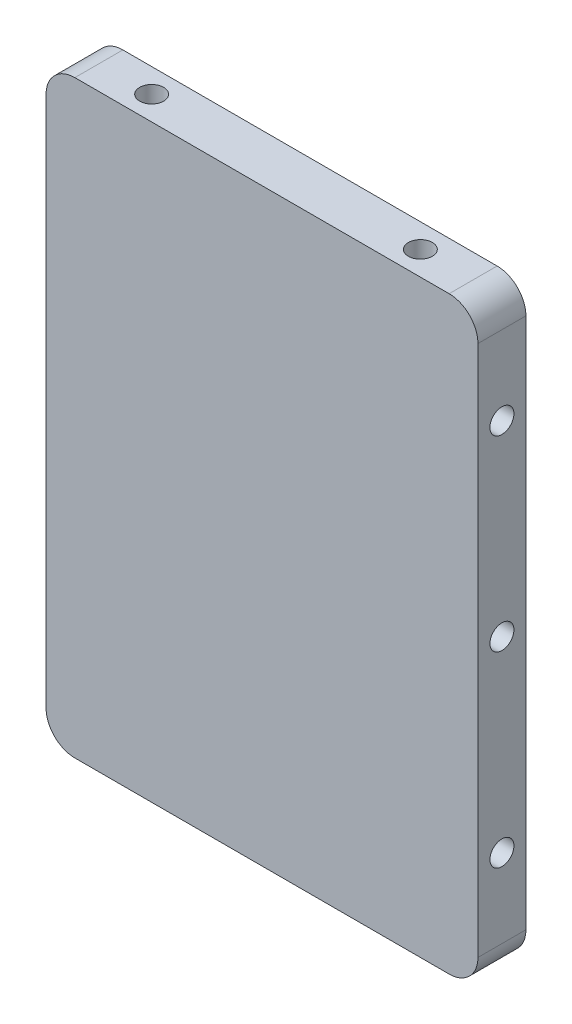
ISO-10303-21;
HEADER;
FILE_DESCRIPTION(('STEP AP214'),'2;1');
FILE_NAME('part.step','',(''),(''),'','','');
FILE_SCHEMA(('AUTOMOTIVE_DESIGN { 1 0 10303 214 1 1 1 1 }'));
ENDSEC;
DATA;
#1=APPLICATION_CONTEXT('core data for automotive mechanical design processes');
#2=APPLICATION_PROTOCOL_DEFINITION('international standard','automotive_design',2000,#1);
#3=PRODUCT_CONTEXT('',#1,'mechanical');
#4=PRODUCT('Part','Part','',(#3));
#5=PRODUCT_RELATED_PRODUCT_CATEGORY('part','',(#4));
#6=PRODUCT_DEFINITION_FORMATION('','',#4);
#7=PRODUCT_DEFINITION_CONTEXT('part definition',#1,'design');
#8=PRODUCT_DEFINITION('design','',#6,#7);
#9=PRODUCT_DEFINITION_SHAPE('','',#8);
#10=(LENGTH_UNIT() NAMED_UNIT(*) SI_UNIT(.MILLI.,.METRE.));
#11=(NAMED_UNIT(*) PLANE_ANGLE_UNIT() SI_UNIT($,.RADIAN.));
#12=(NAMED_UNIT(*) SI_UNIT($,.STERADIAN.) SOLID_ANGLE_UNIT());
#13=UNCERTAINTY_MEASURE_WITH_UNIT(LENGTH_MEASURE(1.E-05),#10,'distance_accuracy_value','');
#14=(GEOMETRIC_REPRESENTATION_CONTEXT(3) GLOBAL_UNCERTAINTY_ASSIGNED_CONTEXT((#13)) GLOBAL_UNIT_ASSIGNED_CONTEXT((#10,
#11,#12)) REPRESENTATION_CONTEXT('',''));
#15=CARTESIAN_POINT('',(0.,0.,0.));
#16=DIRECTION('',(0.,0.,1.));
#17=DIRECTION('',(1.,0.,0.));
#18=AXIS2_PLACEMENT_3D('',#15,#16,#17);
#19=CARTESIAN_POINT('',(22.5,-30.7,5.));
#20=DIRECTION('',(-1.,0.,0.));
#21=DIRECTION('',(0.,0.,1.));
#22=AXIS2_PLACEMENT_3D('',#19,#20,#21);
#23=PLANE('',#22);
#24=CARTESIAN_POINT('',(22.5,-19.5,2.5));
#25=DIRECTION('',(1.,0.,0.));
#26=DIRECTION('',(0.,0.,-1.));
#27=AXIS2_PLACEMENT_3D('',#24,#25,#26);
#28=CIRCLE('',#27,1.24999999999999);
#29=CARTESIAN_POINT('',(22.5,-19.5,1.25000000000001));
#30=VERTEX_POINT('',#29);
#31=EDGE_CURVE('E132',#30,#30,#28,.T.);
#32=ORIENTED_EDGE('',*,*,#31,.F.);
#33=EDGE_LOOP('',(#32));
#34=FACE_BOUND('',#33,.T.);
#35=CARTESIAN_POINT('',(22.5,19.5,2.5));
#36=DIRECTION('',(1.,0.,0.));
#37=DIRECTION('',(0.,0.,-1.));
#38=AXIS2_PLACEMENT_3D('',#35,#36,#37);
#39=CIRCLE('',#38,1.24999999999999);
#40=CARTESIAN_POINT('',(22.5,19.5,1.25000000000001));
#41=VERTEX_POINT('',#40);
#42=EDGE_CURVE('E131',#41,#41,#39,.T.);
#43=ORIENTED_EDGE('',*,*,#42,.F.);
#44=EDGE_LOOP('',(#43));
#45=FACE_BOUND('',#44,.T.);
#46=CARTESIAN_POINT('',(22.5,0.,2.5));
#47=DIRECTION('',(1.,0.,0.));
#48=DIRECTION('',(0.,0.,-1.));
#49=AXIS2_PLACEMENT_3D('',#46,#47,#48);
#50=CIRCLE('',#49,1.24999999999999);
#51=CARTESIAN_POINT('',(22.5,0.,1.25000000000001));
#52=VERTEX_POINT('',#51);
#53=EDGE_CURVE('E142',#52,#52,#50,.T.);
#54=ORIENTED_EDGE('',*,*,#53,.F.);
#55=EDGE_LOOP('',(#54));
#56=FACE_BOUND('',#55,.T.);
#57=DIRECTION('',(0.,1.,0.));
#58=VECTOR('',#57,1.);
#59=CARTESIAN_POINT('',(22.5,-30.7,5.));
#60=LINE('',#59,#58);
#61=CARTESIAN_POINT('',(22.5,-27.7,5.));
#62=VERTEX_POINT('',#61);
#63=CARTESIAN_POINT('',(22.5,27.7,5.));
#64=VERTEX_POINT('',#63);
#65=EDGE_CURVE('E179',#62,#64,#60,.T.);
#66=ORIENTED_EDGE('',*,*,#65,.F.);
#67=DIRECTION('',(0.,0.,-1.));
#68=VECTOR('',#67,1.);
#69=CARTESIAN_POINT('',(22.5,-27.7,5.));
#70=LINE('',#69,#68);
#71=CARTESIAN_POINT('',(22.5,-27.7,0.));
#72=VERTEX_POINT('',#71);
#73=EDGE_CURVE('E201',#62,#72,#70,.T.);
#74=ORIENTED_EDGE('',*,*,#73,.T.);
#75=DIRECTION('',(0.,1.,0.));
#76=VECTOR('',#75,1.);
#77=CARTESIAN_POINT('',(22.5,-30.7,0.));
#78=LINE('',#77,#76);
#79=CARTESIAN_POINT('',(22.5,27.7,0.));
#80=VERTEX_POINT('',#79);
#81=EDGE_CURVE('E178',#72,#80,#78,.T.);
#82=ORIENTED_EDGE('',*,*,#81,.T.);
#83=DIRECTION('',(0.,0.,-1.));
#84=VECTOR('',#83,1.);
#85=CARTESIAN_POINT('',(22.5,27.7,5.));
#86=LINE('',#85,#84);
#87=EDGE_CURVE('E190',#80,#64,#86,.F.);
#88=ORIENTED_EDGE('',*,*,#87,.T.);
#89=EDGE_LOOP('',(#66,#74,#82,#88));
#90=FACE_BOUND('',#89,.T.);
#91=ADVANCED_FACE('F38',(#34,#45,#56,#90),#23,.F.);
#92=CARTESIAN_POINT('',(-22.5,30.7,5.));
#93=DIRECTION('',(0.,-1.,0.));
#94=DIRECTION('',(0.,0.,-1.));
#95=AXIS2_PLACEMENT_3D('',#92,#93,#94);
#96=PLANE('',#95);
#97=CARTESIAN_POINT('',(-14.,30.7,2.5));
#98=DIRECTION('',(0.,-1.,0.));
#99=DIRECTION('',(0.,0.,-1.));
#100=AXIS2_PLACEMENT_3D('',#97,#98,#99);
#101=CIRCLE('',#100,1.24999999999998);
#102=CARTESIAN_POINT('',(-14.,30.7,1.25000000000002));
#103=VERTEX_POINT('',#102);
#104=EDGE_CURVE('E151',#103,#103,#101,.T.);
#105=ORIENTED_EDGE('',*,*,#104,.T.);
#106=EDGE_LOOP('',(#105));
#107=FACE_BOUND('',#106,.T.);
#108=CARTESIAN_POINT('',(14.,30.7,2.5));
#109=DIRECTION('',(0.,-1.,0.));
#110=DIRECTION('',(0.,0.,-1.));
#111=AXIS2_PLACEMENT_3D('',#108,#109,#110);
#112=CIRCLE('',#111,1.24999999999998);
#113=CARTESIAN_POINT('',(14.,30.7,1.25000000000002));
#114=VERTEX_POINT('',#113);
#115=EDGE_CURVE('E157',#114,#114,#112,.T.);
#116=ORIENTED_EDGE('',*,*,#115,.T.);
#117=EDGE_LOOP('',(#116));
#118=FACE_BOUND('',#117,.T.);
#119=DIRECTION('',(-1.,0.,0.));
#120=VECTOR('',#119,1.);
#121=CARTESIAN_POINT('',(-22.5,30.7,5.));
#122=LINE('',#121,#120);
#123=CARTESIAN_POINT('',(19.5,30.7,5.));
#124=VERTEX_POINT('',#123);
#125=CARTESIAN_POINT('',(-19.5,30.7,5.));
#126=VERTEX_POINT('',#125);
#127=EDGE_CURVE('E182',#124,#126,#122,.T.);
#128=ORIENTED_EDGE('',*,*,#127,.F.);
#129=DIRECTION('',(0.,0.,-1.));
#130=VECTOR('',#129,1.);
#131=CARTESIAN_POINT('',(19.5,30.7,5.));
#132=LINE('',#131,#130);
#133=CARTESIAN_POINT('',(19.5,30.7,0.));
#134=VERTEX_POINT('',#133);
#135=EDGE_CURVE('E11',#124,#134,#132,.T.);
#136=ORIENTED_EDGE('',*,*,#135,.T.);
#137=DIRECTION('',(-1.,0.,0.));
#138=VECTOR('',#137,1.);
#139=CARTESIAN_POINT('',(-22.5,30.7,0.));
#140=LINE('',#139,#138);
#141=CARTESIAN_POINT('',(-19.5,30.7,0.));
#142=VERTEX_POINT('',#141);
#143=EDGE_CURVE('E193',#134,#142,#140,.T.);
#144=ORIENTED_EDGE('',*,*,#143,.T.);
#145=DIRECTION('',(0.,0.,-1.));
#146=VECTOR('',#145,1.);
#147=CARTESIAN_POINT('',(-19.5,30.7,5.));
#148=LINE('',#147,#146);
#149=EDGE_CURVE('E46',#142,#126,#148,.F.);
#150=ORIENTED_EDGE('',*,*,#149,.T.);
#151=EDGE_LOOP('',(#128,#136,#144,#150));
#152=FACE_BOUND('',#151,.T.);
#153=ADVANCED_FACE('F230',(#107,#118,#152),#96,.F.);
#154=CARTESIAN_POINT('',(-22.5,-30.7,5.));
#155=DIRECTION('',(1.,0.,0.));
#156=DIRECTION('',(0.,0.,-1.));
#157=AXIS2_PLACEMENT_3D('',#154,#155,#156);
#158=PLANE('',#157);
#159=CARTESIAN_POINT('',(-22.5,-19.5,2.5));
#160=DIRECTION('',(-1.,0.,0.));
#161=DIRECTION('',(0.,0.,1.));
#162=AXIS2_PLACEMENT_3D('',#159,#160,#161);
#163=CIRCLE('',#162,1.24999999999999);
#164=CARTESIAN_POINT('',(-22.5,-19.5,3.74999999999999));
#165=VERTEX_POINT('',#164);
#166=EDGE_CURVE('E160',#165,#165,#163,.T.);
#167=ORIENTED_EDGE('',*,*,#166,.F.);
#168=EDGE_LOOP('',(#167));
#169=FACE_BOUND('',#168,.T.);
#170=CARTESIAN_POINT('',(-22.5,19.5,2.5));
#171=DIRECTION('',(-1.,0.,0.));
#172=DIRECTION('',(0.,0.,1.));
#173=AXIS2_PLACEMENT_3D('',#170,#171,#172);
#174=CIRCLE('',#173,1.24999999999999);
#175=CARTESIAN_POINT('',(-22.5,19.5,3.74999999999999));
#176=VERTEX_POINT('',#175);
#177=EDGE_CURVE('E166',#176,#176,#174,.T.);
#178=ORIENTED_EDGE('',*,*,#177,.F.);
#179=EDGE_LOOP('',(#178));
#180=FACE_BOUND('',#179,.T.);
#181=CARTESIAN_POINT('',(-22.5,0.,2.5));
#182=DIRECTION('',(-1.,0.,0.));
#183=DIRECTION('',(0.,0.,1.));
#184=AXIS2_PLACEMENT_3D('',#181,#182,#183);
#185=CIRCLE('',#184,1.24999999999999);
#186=CARTESIAN_POINT('',(-22.5,0.,3.74999999999999));
#187=VERTEX_POINT('',#186);
#188=EDGE_CURVE('E172',#187,#187,#185,.T.);
#189=ORIENTED_EDGE('',*,*,#188,.F.);
#190=EDGE_LOOP('',(#189));
#191=FACE_BOUND('',#190,.T.);
#192=DIRECTION('',(0.,-1.,0.));
#193=VECTOR('',#192,1.);
#194=CARTESIAN_POINT('',(-22.5,-30.7,0.));
#195=LINE('',#194,#193);
#196=CARTESIAN_POINT('',(-22.5,27.7,0.));
#197=VERTEX_POINT('',#196);
#198=CARTESIAN_POINT('',(-22.5,-27.7,0.));
#199=VERTEX_POINT('',#198);
#200=EDGE_CURVE('E196',#197,#199,#195,.T.);
#201=ORIENTED_EDGE('',*,*,#200,.T.);
#202=DIRECTION('',(0.,0.,-1.));
#203=VECTOR('',#202,1.);
#204=CARTESIAN_POINT('',(-22.5,-27.7,5.));
#205=LINE('',#204,#203);
#206=CARTESIAN_POINT('',(-22.5,-27.7,5.));
#207=VERTEX_POINT('',#206);
#208=EDGE_CURVE('E53',#199,#207,#205,.F.);
#209=ORIENTED_EDGE('',*,*,#208,.T.);
#210=DIRECTION('',(0.,-1.,0.));
#211=VECTOR('',#210,1.);
#212=CARTESIAN_POINT('',(-22.5,-30.7,5.));
#213=LINE('',#212,#211);
#214=CARTESIAN_POINT('',(-22.5,27.7,5.));
#215=VERTEX_POINT('',#214);
#216=EDGE_CURVE('E185',#215,#207,#213,.T.);
#217=ORIENTED_EDGE('',*,*,#216,.F.);
#218=DIRECTION('',(0.,0.,-1.));
#219=VECTOR('',#218,1.);
#220=CARTESIAN_POINT('',(-22.5,27.7,5.));
#221=LINE('',#220,#219);
#222=EDGE_CURVE('E224',#215,#197,#221,.T.);
#223=ORIENTED_EDGE('',*,*,#222,.T.);
#224=EDGE_LOOP('',(#201,#209,#217,#223));
#225=FACE_BOUND('',#224,.T.);
#226=ADVANCED_FACE('F238',(#169,#180,#191,#225),#158,.F.);
#227=CARTESIAN_POINT('',(-22.5,-30.7,5.));
#228=DIRECTION('',(0.,1.,0.));
#229=DIRECTION('',(0.,0.,1.));
#230=AXIS2_PLACEMENT_3D('',#227,#228,#229);
#231=PLANE('',#230);
#232=CARTESIAN_POINT('',(-14.,-30.7,2.5));
#233=DIRECTION('',(0.,-1.,0.));
#234=DIRECTION('',(0.,0.,-1.));
#235=AXIS2_PLACEMENT_3D('',#232,#233,#234);
#236=CIRCLE('',#235,1.24999999999999);
#237=CARTESIAN_POINT('',(-14.,-30.7,1.25000000000001));
#238=VERTEX_POINT('',#237);
#239=EDGE_CURVE('E148',#238,#238,#236,.T.);
#240=ORIENTED_EDGE('',*,*,#239,.F.);
#241=EDGE_LOOP('',(#240));
#242=FACE_BOUND('',#241,.T.);
#243=CARTESIAN_POINT('',(14.,-30.7,2.5));
#244=DIRECTION('',(0.,-1.,0.));
#245=DIRECTION('',(0.,0.,-1.));
#246=AXIS2_PLACEMENT_3D('',#243,#244,#245);
#247=CIRCLE('',#246,1.24999999999999);
#248=CARTESIAN_POINT('',(14.,-30.7,1.25000000000001));
#249=VERTEX_POINT('',#248);
#250=EDGE_CURVE('E154',#249,#249,#247,.T.);
#251=ORIENTED_EDGE('',*,*,#250,.F.);
#252=EDGE_LOOP('',(#251));
#253=FACE_BOUND('',#252,.T.);
#254=DIRECTION('',(1.,0.,0.));
#255=VECTOR('',#254,1.);
#256=CARTESIAN_POINT('',(-22.5,-30.7,0.));
#257=LINE('',#256,#255);
#258=CARTESIAN_POINT('',(-19.5,-30.7,0.));
#259=VERTEX_POINT('',#258);
#260=CARTESIAN_POINT('',(19.5,-30.7,0.));
#261=VERTEX_POINT('',#260);
#262=EDGE_CURVE('E183',#259,#261,#257,.T.);
#263=ORIENTED_EDGE('',*,*,#262,.T.);
#264=DIRECTION('',(0.,0.,-1.));
#265=VECTOR('',#264,1.);
#266=CARTESIAN_POINT('',(19.5,-30.7,5.));
#267=LINE('',#266,#265);
#268=CARTESIAN_POINT('',(19.5,-30.7,5.));
#269=VERTEX_POINT('',#268);
#270=EDGE_CURVE('E215',#261,#269,#267,.F.);
#271=ORIENTED_EDGE('',*,*,#270,.T.);
#272=DIRECTION('',(1.,0.,0.));
#273=VECTOR('',#272,1.);
#274=CARTESIAN_POINT('',(-22.5,-30.7,5.));
#275=LINE('',#274,#273);
#276=CARTESIAN_POINT('',(-19.5,-30.7,5.));
#277=VERTEX_POINT('',#276);
#278=EDGE_CURVE('E187',#277,#269,#275,.T.);
#279=ORIENTED_EDGE('',*,*,#278,.F.);
#280=DIRECTION('',(0.,0.,-1.));
#281=VECTOR('',#280,1.);
#282=CARTESIAN_POINT('',(-19.5,-30.7,5.));
#283=LINE('',#282,#281);
#284=EDGE_CURVE('E212',#277,#259,#283,.T.);
#285=ORIENTED_EDGE('',*,*,#284,.T.);
#286=EDGE_LOOP('',(#263,#271,#279,#285));
#287=FACE_BOUND('',#286,.T.);
#288=ADVANCED_FACE('F249',(#242,#253,#287),#231,.F.);
#289=CARTESIAN_POINT('',(0.,0.,5.));
#290=DIRECTION('',(0.,0.,-1.));
#291=DIRECTION('',(-1.,0.,0.));
#292=AXIS2_PLACEMENT_3D('',#289,#290,#291);
#293=PLANE('',#292);
#294=ORIENTED_EDGE('',*,*,#278,.T.);
#295=CARTESIAN_POINT('',(19.5,-27.7,5.));
#296=DIRECTION('',(0.,0.,-1.));
#297=DIRECTION('',(-1.,0.,0.));
#298=AXIS2_PLACEMENT_3D('',#295,#296,#297);
#299=CIRCLE('',#298,3.);
#300=EDGE_CURVE('E222',#269,#62,#299,.F.);
#301=ORIENTED_EDGE('',*,*,#300,.T.);
#302=ORIENTED_EDGE('',*,*,#65,.T.);
#303=CARTESIAN_POINT('',(19.5,27.7,5.));
#304=DIRECTION('',(0.,0.,-1.));
#305=DIRECTION('',(-1.,0.,0.));
#306=AXIS2_PLACEMENT_3D('',#303,#304,#305);
#307=CIRCLE('',#306,3.);
#308=EDGE_CURVE('E218',#64,#124,#307,.F.);
#309=ORIENTED_EDGE('',*,*,#308,.T.);
#310=ORIENTED_EDGE('',*,*,#127,.T.);
#311=CARTESIAN_POINT('',(-19.5,27.7,5.));
#312=DIRECTION('',(0.,0.,-1.));
#313=DIRECTION('',(-1.,0.,0.));
#314=AXIS2_PLACEMENT_3D('',#311,#312,#313);
#315=CIRCLE('',#314,3.);
#316=EDGE_CURVE('E60',#126,#215,#315,.F.);
#317=ORIENTED_EDGE('',*,*,#316,.T.);
#318=ORIENTED_EDGE('',*,*,#216,.T.);
#319=CARTESIAN_POINT('',(-19.5,-27.7,5.));
#320=DIRECTION('',(0.,0.,-1.));
#321=DIRECTION('',(-1.,0.,0.));
#322=AXIS2_PLACEMENT_3D('',#319,#320,#321);
#323=CIRCLE('',#322,3.);
#324=EDGE_CURVE('E220',#207,#277,#323,.F.);
#325=ORIENTED_EDGE('',*,*,#324,.T.);
#326=EDGE_LOOP('',(#294,#301,#302,#309,#310,#317,#318,#325));
#327=FACE_BOUND('',#326,.T.);
#328=ADVANCED_FACE('F234',(#327),#293,.F.);
#329=CARTESIAN_POINT('',(0.,0.,0.));
#330=DIRECTION('',(0.,0.,-1.));
#331=DIRECTION('',(-1.,0.,0.));
#332=AXIS2_PLACEMENT_3D('',#329,#330,#331);
#333=PLANE('',#332);
#334=ORIENTED_EDGE('',*,*,#81,.F.);
#335=CARTESIAN_POINT('',(19.5,-27.7,0.));
#336=DIRECTION('',(0.,0.,-1.));
#337=DIRECTION('',(-1.,0.,0.));
#338=AXIS2_PLACEMENT_3D('',#335,#336,#337);
#339=CIRCLE('',#338,3.);
#340=EDGE_CURVE('E210',#72,#261,#339,.T.);
#341=ORIENTED_EDGE('',*,*,#340,.T.);
#342=ORIENTED_EDGE('',*,*,#262,.F.);
#343=CARTESIAN_POINT('',(-19.5,-27.7,0.));
#344=DIRECTION('',(0.,0.,-1.));
#345=DIRECTION('',(-1.,0.,0.));
#346=AXIS2_PLACEMENT_3D('',#343,#344,#345);
#347=CIRCLE('',#346,3.);
#348=EDGE_CURVE('E208',#259,#199,#347,.T.);
#349=ORIENTED_EDGE('',*,*,#348,.T.);
#350=ORIENTED_EDGE('',*,*,#200,.F.);
#351=CARTESIAN_POINT('',(-19.5,27.7,0.));
#352=DIRECTION('',(0.,0.,-1.));
#353=DIRECTION('',(-1.,0.,0.));
#354=AXIS2_PLACEMENT_3D('',#351,#352,#353);
#355=CIRCLE('',#354,3.);
#356=EDGE_CURVE('E204',#197,#142,#355,.T.);
#357=ORIENTED_EDGE('',*,*,#356,.T.);
#358=ORIENTED_EDGE('',*,*,#143,.F.);
#359=CARTESIAN_POINT('',(19.5,27.7,0.));
#360=DIRECTION('',(0.,0.,-1.));
#361=DIRECTION('',(-1.,0.,0.));
#362=AXIS2_PLACEMENT_3D('',#359,#360,#361);
#363=CIRCLE('',#362,3.);
#364=EDGE_CURVE('E206',#134,#80,#363,.T.);
#365=ORIENTED_EDGE('',*,*,#364,.T.);
#366=EDGE_LOOP('',(#334,#341,#342,#349,#350,#357,#358,#365));
#367=FACE_BOUND('',#366,.T.);
#368=ADVANCED_FACE('F241',(#367),#333,.T.);
#369=CARTESIAN_POINT('',(-17.5,0.,2.5));
#370=DIRECTION('',(-1.,0.,0.));
#371=DIRECTION('',(0.,0.,1.));
#372=AXIS2_PLACEMENT_3D('',#369,#370,#371);
#373=CONICAL_SURFACE('',#372,1.25,1.02974425867665);
#374=CARTESIAN_POINT('',(-16.7489242262156,0.,2.5));
#375=VERTEX_POINT('',#374);
#376=VERTEX_LOOP('',#375);
#377=FACE_BOUND('',#376,.T.);
#378=CARTESIAN_POINT('',(-17.5,0.,2.5));
#379=DIRECTION('',(-1.,0.,0.));
#380=DIRECTION('',(0.,0.,1.));
#381=AXIS2_PLACEMENT_3D('',#378,#379,#380);
#382=CIRCLE('',#381,1.25);
#383=CARTESIAN_POINT('',(-17.5,0.,3.75));
#384=VERTEX_POINT('',#383);
#385=EDGE_CURVE('E175',#384,#384,#382,.T.);
#386=ORIENTED_EDGE('',*,*,#385,.T.);
#387=EDGE_LOOP('',(#386));
#388=FACE_BOUND('',#387,.T.);
#389=ADVANCED_FACE('F329',(#377,#388),#373,.F.);
#390=CARTESIAN_POINT('',(-22.5,0.,2.5));
#391=DIRECTION('',(-1.,0.,0.));
#392=DIRECTION('',(0.,0.,1.));
#393=AXIS2_PLACEMENT_3D('',#390,#391,#392);
#394=CYLINDRICAL_SURFACE('',#393,1.24999999999999);
#395=ORIENTED_EDGE('',*,*,#385,.F.);
#396=EDGE_LOOP('',(#395));
#397=FACE_BOUND('',#396,.T.);
#398=ORIENTED_EDGE('',*,*,#188,.T.);
#399=EDGE_LOOP('',(#398));
#400=FACE_BOUND('',#399,.T.);
#401=ADVANCED_FACE('F325',(#397,#400),#394,.F.);
#402=CARTESIAN_POINT('',(-17.5,19.5,2.5));
#403=DIRECTION('',(-1.,0.,0.));
#404=DIRECTION('',(0.,0.,1.));
#405=AXIS2_PLACEMENT_3D('',#402,#403,#404);
#406=CONICAL_SURFACE('',#405,1.25,1.02974425867665);
#407=CARTESIAN_POINT('',(-16.7489242262156,19.5,2.5));
#408=VERTEX_POINT('',#407);
#409=VERTEX_LOOP('',#408);
#410=FACE_BOUND('',#409,.T.);
#411=CARTESIAN_POINT('',(-17.5,19.5,2.5));
#412=DIRECTION('',(-1.,0.,0.));
#413=DIRECTION('',(0.,0.,1.));
#414=AXIS2_PLACEMENT_3D('',#411,#412,#413);
#415=CIRCLE('',#414,1.25);
#416=CARTESIAN_POINT('',(-17.5,19.5,3.75));
#417=VERTEX_POINT('',#416);
#418=EDGE_CURVE('E169',#417,#417,#415,.T.);
#419=ORIENTED_EDGE('',*,*,#418,.T.);
#420=EDGE_LOOP('',(#419));
#421=FACE_BOUND('',#420,.T.);
#422=ADVANCED_FACE('F321',(#410,#421),#406,.F.);
#423=CARTESIAN_POINT('',(-22.5,19.5,2.5));
#424=DIRECTION('',(-1.,0.,0.));
#425=DIRECTION('',(0.,0.,1.));
#426=AXIS2_PLACEMENT_3D('',#423,#424,#425);
#427=CYLINDRICAL_SURFACE('',#426,1.24999999999999);
#428=ORIENTED_EDGE('',*,*,#418,.F.);
#429=EDGE_LOOP('',(#428));
#430=FACE_BOUND('',#429,.T.);
#431=ORIENTED_EDGE('',*,*,#177,.T.);
#432=EDGE_LOOP('',(#431));
#433=FACE_BOUND('',#432,.T.);
#434=ADVANCED_FACE('F317',(#430,#433),#427,.F.);
#435=CARTESIAN_POINT('',(-17.5,-19.5,2.5));
#436=DIRECTION('',(-1.,0.,0.));
#437=DIRECTION('',(0.,0.,1.));
#438=AXIS2_PLACEMENT_3D('',#435,#436,#437);
#439=CONICAL_SURFACE('',#438,1.25,1.02974425867665);
#440=CARTESIAN_POINT('',(-16.7489242262156,-19.5,2.5));
#441=VERTEX_POINT('',#440);
#442=VERTEX_LOOP('',#441);
#443=FACE_BOUND('',#442,.T.);
#444=CARTESIAN_POINT('',(-17.5,-19.5,2.5));
#445=DIRECTION('',(-1.,0.,0.));
#446=DIRECTION('',(0.,0.,1.));
#447=AXIS2_PLACEMENT_3D('',#444,#445,#446);
#448=CIRCLE('',#447,1.25);
#449=CARTESIAN_POINT('',(-17.5,-19.5,3.75));
#450=VERTEX_POINT('',#449);
#451=EDGE_CURVE('E163',#450,#450,#448,.T.);
#452=ORIENTED_EDGE('',*,*,#451,.T.);
#453=EDGE_LOOP('',(#452));
#454=FACE_BOUND('',#453,.T.);
#455=ADVANCED_FACE('F313',(#443,#454),#439,.F.);
#456=CARTESIAN_POINT('',(-22.5,-19.5,2.5));
#457=DIRECTION('',(-1.,0.,0.));
#458=DIRECTION('',(0.,0.,1.));
#459=AXIS2_PLACEMENT_3D('',#456,#457,#458);
#460=CYLINDRICAL_SURFACE('',#459,1.24999999999999);
#461=ORIENTED_EDGE('',*,*,#451,.F.);
#462=EDGE_LOOP('',(#461));
#463=FACE_BOUND('',#462,.T.);
#464=ORIENTED_EDGE('',*,*,#166,.T.);
#465=EDGE_LOOP('',(#464));
#466=FACE_BOUND('',#465,.T.);
#467=ADVANCED_FACE('F309',(#463,#466),#460,.F.);
#468=CARTESIAN_POINT('',(14.,-30.7,2.5));
#469=DIRECTION('',(0.,-1.,0.));
#470=DIRECTION('',(0.,0.,-1.));
#471=AXIS2_PLACEMENT_3D('',#468,#469,#470);
#472=CYLINDRICAL_SURFACE('',#471,1.24999999999999);
#473=ORIENTED_EDGE('',*,*,#115,.F.);
#474=EDGE_LOOP('',(#473));
#475=FACE_BOUND('',#474,.T.);
#476=ORIENTED_EDGE('',*,*,#250,.T.);
#477=EDGE_LOOP('',(#476));
#478=FACE_BOUND('',#477,.T.);
#479=ADVANCED_FACE('F305',(#475,#478),#472,.F.);
#480=CARTESIAN_POINT('',(-14.,-30.7,2.5));
#481=DIRECTION('',(0.,-1.,0.));
#482=DIRECTION('',(0.,0.,-1.));
#483=AXIS2_PLACEMENT_3D('',#480,#481,#482);
#484=CYLINDRICAL_SURFACE('',#483,1.24999999999999);
#485=ORIENTED_EDGE('',*,*,#104,.F.);
#486=EDGE_LOOP('',(#485));
#487=FACE_BOUND('',#486,.T.);
#488=ORIENTED_EDGE('',*,*,#239,.T.);
#489=EDGE_LOOP('',(#488));
#490=FACE_BOUND('',#489,.T.);
#491=ADVANCED_FACE('F301',(#487,#490),#484,.F.);
#492=CARTESIAN_POINT('',(17.5,0.,2.5));
#493=DIRECTION('',(1.,0.,0.));
#494=DIRECTION('',(0.,0.,-1.));
#495=AXIS2_PLACEMENT_3D('',#492,#493,#494);
#496=CONICAL_SURFACE('',#495,1.25,1.02974425867665);
#497=CARTESIAN_POINT('',(16.7489242262156,0.,2.5));
#498=VERTEX_POINT('',#497);
#499=VERTEX_LOOP('',#498);
#500=FACE_BOUND('',#499,.T.);
#501=CARTESIAN_POINT('',(17.5,0.,2.5));
#502=DIRECTION('',(1.,0.,0.));
#503=DIRECTION('',(0.,0.,-1.));
#504=AXIS2_PLACEMENT_3D('',#501,#502,#503);
#505=CIRCLE('',#504,1.25);
#506=CARTESIAN_POINT('',(17.5,0.,1.25000000000001));
#507=VERTEX_POINT('',#506);
#508=EDGE_CURVE('E145',#507,#507,#505,.T.);
#509=ORIENTED_EDGE('',*,*,#508,.T.);
#510=EDGE_LOOP('',(#509));
#511=FACE_BOUND('',#510,.T.);
#512=ADVANCED_FACE('F297',(#500,#511),#496,.F.);
#513=CARTESIAN_POINT('',(22.5,0.,2.5));
#514=DIRECTION('',(1.,0.,0.));
#515=DIRECTION('',(0.,0.,-1.));
#516=AXIS2_PLACEMENT_3D('',#513,#514,#515);
#517=CYLINDRICAL_SURFACE('',#516,1.24999999999999);
#518=ORIENTED_EDGE('',*,*,#508,.F.);
#519=EDGE_LOOP('',(#518));
#520=FACE_BOUND('',#519,.T.);
#521=ORIENTED_EDGE('',*,*,#53,.T.);
#522=EDGE_LOOP('',(#521));
#523=FACE_BOUND('',#522,.T.);
#524=ADVANCED_FACE('F293',(#520,#523),#517,.F.);
#525=CARTESIAN_POINT('',(17.5,19.5,2.5));
#526=DIRECTION('',(1.,0.,0.));
#527=DIRECTION('',(0.,0.,-1.));
#528=AXIS2_PLACEMENT_3D('',#525,#526,#527);
#529=CONICAL_SURFACE('',#528,1.25,1.02974425867665);
#530=CARTESIAN_POINT('',(16.7489242262156,19.5,2.5));
#531=VERTEX_POINT('',#530);
#532=VERTEX_LOOP('',#531);
#533=FACE_BOUND('',#532,.T.);
#534=CARTESIAN_POINT('',(17.5,19.5,2.5));
#535=DIRECTION('',(1.,0.,0.));
#536=DIRECTION('',(0.,0.,-1.));
#537=AXIS2_PLACEMENT_3D('',#534,#535,#536);
#538=CIRCLE('',#537,1.25);
#539=CARTESIAN_POINT('',(17.5,19.5,1.25));
#540=VERTEX_POINT('',#539);
#541=EDGE_CURVE('E135',#540,#540,#538,.T.);
#542=ORIENTED_EDGE('',*,*,#541,.T.);
#543=EDGE_LOOP('',(#542));
#544=FACE_BOUND('',#543,.T.);
#545=ADVANCED_FACE('F289',(#533,#544),#529,.F.);
#546=CARTESIAN_POINT('',(22.5,19.5,2.5));
#547=DIRECTION('',(1.,0.,0.));
#548=DIRECTION('',(0.,0.,-1.));
#549=AXIS2_PLACEMENT_3D('',#546,#547,#548);
#550=CYLINDRICAL_SURFACE('',#549,1.24999999999999);
#551=ORIENTED_EDGE('',*,*,#541,.F.);
#552=EDGE_LOOP('',(#551));
#553=FACE_BOUND('',#552,.T.);
#554=ORIENTED_EDGE('',*,*,#42,.T.);
#555=EDGE_LOOP('',(#554));
#556=FACE_BOUND('',#555,.T.);
#557=ADVANCED_FACE('F125',(#553,#556),#550,.F.);
#558=CARTESIAN_POINT('',(17.5,-19.5,2.5));
#559=DIRECTION('',(1.,0.,0.));
#560=DIRECTION('',(0.,0.,-1.));
#561=AXIS2_PLACEMENT_3D('',#558,#559,#560);
#562=CONICAL_SURFACE('',#561,1.25,1.02974425867665);
#563=CARTESIAN_POINT('',(16.7489242262156,-19.5,2.5));
#564=VERTEX_POINT('',#563);
#565=VERTEX_LOOP('',#564);
#566=FACE_BOUND('',#565,.T.);
#567=CARTESIAN_POINT('',(17.5,-19.5,2.5));
#568=DIRECTION('',(1.,0.,0.));
#569=DIRECTION('',(0.,0.,-1.));
#570=AXIS2_PLACEMENT_3D('',#567,#568,#569);
#571=CIRCLE('',#570,1.25);
#572=CARTESIAN_POINT('',(17.5,-19.5,1.25));
#573=VERTEX_POINT('',#572);
#574=EDGE_CURVE('E129',#573,#573,#571,.T.);
#575=ORIENTED_EDGE('',*,*,#574,.T.);
#576=EDGE_LOOP('',(#575));
#577=FACE_BOUND('',#576,.T.);
#578=ADVANCED_FACE('F121',(#566,#577),#562,.F.);
#579=CARTESIAN_POINT('',(22.5,-19.5,2.5));
#580=DIRECTION('',(1.,0.,0.));
#581=DIRECTION('',(0.,0.,-1.));
#582=AXIS2_PLACEMENT_3D('',#579,#580,#581);
#583=CYLINDRICAL_SURFACE('',#582,1.24999999999999);
#584=ORIENTED_EDGE('',*,*,#574,.F.);
#585=EDGE_LOOP('',(#584));
#586=FACE_BOUND('',#585,.T.);
#587=ORIENTED_EDGE('',*,*,#31,.T.);
#588=EDGE_LOOP('',(#587));
#589=FACE_BOUND('',#588,.T.);
#590=ADVANCED_FACE('F124',(#586,#589),#583,.F.);
#591=CARTESIAN_POINT('',(19.5,-27.7,5.));
#592=DIRECTION('',(0.,0.,-1.));
#593=DIRECTION('',(-1.,0.,0.));
#594=AXIS2_PLACEMENT_3D('',#591,#592,#593);
#595=CYLINDRICAL_SURFACE('',#594,3.);
#596=ORIENTED_EDGE('',*,*,#300,.F.);
#597=ORIENTED_EDGE('',*,*,#270,.F.);
#598=ORIENTED_EDGE('',*,*,#340,.F.);
#599=ORIENTED_EDGE('',*,*,#73,.F.);
#600=EDGE_LOOP('',(#596,#597,#598,#599));
#601=FACE_BOUND('',#600,.T.);
#602=ADVANCED_FACE('F255',(#601),#595,.T.);
#603=CARTESIAN_POINT('',(-19.5,-27.7,5.));
#604=DIRECTION('',(0.,0.,-1.));
#605=DIRECTION('',(-1.,0.,0.));
#606=AXIS2_PLACEMENT_3D('',#603,#604,#605);
#607=CYLINDRICAL_SURFACE('',#606,3.);
#608=ORIENTED_EDGE('',*,*,#324,.F.);
#609=ORIENTED_EDGE('',*,*,#208,.F.);
#610=ORIENTED_EDGE('',*,*,#348,.F.);
#611=ORIENTED_EDGE('',*,*,#284,.F.);
#612=EDGE_LOOP('',(#608,#609,#610,#611));
#613=FACE_BOUND('',#612,.T.);
#614=ADVANCED_FACE('F246',(#613),#607,.T.);
#615=CARTESIAN_POINT('',(19.5,27.7,5.));
#616=DIRECTION('',(0.,0.,-1.));
#617=DIRECTION('',(-1.,0.,0.));
#618=AXIS2_PLACEMENT_3D('',#615,#616,#617);
#619=CYLINDRICAL_SURFACE('',#618,3.);
#620=ORIENTED_EDGE('',*,*,#308,.F.);
#621=ORIENTED_EDGE('',*,*,#87,.F.);
#622=ORIENTED_EDGE('',*,*,#364,.F.);
#623=ORIENTED_EDGE('',*,*,#135,.F.);
#624=EDGE_LOOP('',(#620,#621,#622,#623));
#625=FACE_BOUND('',#624,.T.);
#626=ADVANCED_FACE('F259',(#625),#619,.T.);
#627=CARTESIAN_POINT('',(-19.5,27.7,5.));
#628=DIRECTION('',(0.,0.,-1.));
#629=DIRECTION('',(-1.,0.,0.));
#630=AXIS2_PLACEMENT_3D('',#627,#628,#629);
#631=CYLINDRICAL_SURFACE('',#630,3.);
#632=ORIENTED_EDGE('',*,*,#316,.F.);
#633=ORIENTED_EDGE('',*,*,#149,.F.);
#634=ORIENTED_EDGE('',*,*,#356,.F.);
#635=ORIENTED_EDGE('',*,*,#222,.F.);
#636=EDGE_LOOP('',(#632,#633,#634,#635));
#637=FACE_BOUND('',#636,.T.);
#638=ADVANCED_FACE('F40',(#637),#631,.T.);
#639=CLOSED_SHELL('',(#91,#153,#226,#288,#328,#368,#389,#401,#422,#434,#455,#467,#479,#491,#512,
#524,#545,#557,#578,#590,#602,#614,#626,#638));
#640=MANIFOLD_SOLID_BREP('B2',#639);
#641=ADVANCED_BREP_SHAPE_REPRESENTATION('',(#18,#640),#14);
#642=SHAPE_DEFINITION_REPRESENTATION(#9,#641);
ENDSEC;
END-ISO-10303-21;
